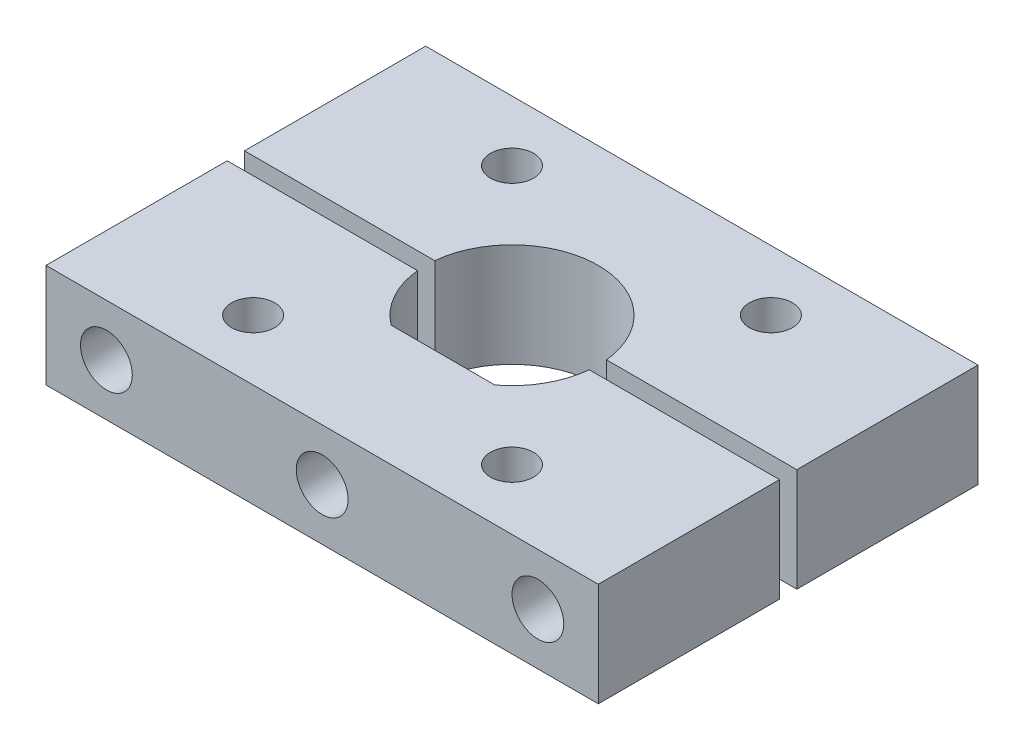
ISO-10303-21;
HEADER;
FILE_DESCRIPTION(('STEP AP214'),'2;1');
FILE_NAME('part.step','',(''),(''),'','','');
FILE_SCHEMA(('AUTOMOTIVE_DESIGN { 1 0 10303 214 1 1 1 1 }'));
ENDSEC;
DATA;
#1=APPLICATION_CONTEXT('core data for automotive mechanical design processes');
#2=APPLICATION_PROTOCOL_DEFINITION('international standard','automotive_design',2000,#1);
#3=PRODUCT_CONTEXT('',#1,'mechanical');
#4=PRODUCT('Part','Part','',(#3));
#5=PRODUCT_RELATED_PRODUCT_CATEGORY('part','',(#4));
#6=PRODUCT_DEFINITION_FORMATION('','',#4);
#7=PRODUCT_DEFINITION_CONTEXT('part definition',#1,'design');
#8=PRODUCT_DEFINITION('design','',#6,#7);
#9=PRODUCT_DEFINITION_SHAPE('','',#8);
#10=(LENGTH_UNIT() NAMED_UNIT(*) SI_UNIT(.MILLI.,.METRE.));
#11=(NAMED_UNIT(*) PLANE_ANGLE_UNIT() SI_UNIT($,.RADIAN.));
#12=(NAMED_UNIT(*) SI_UNIT($,.STERADIAN.) SOLID_ANGLE_UNIT());
#13=UNCERTAINTY_MEASURE_WITH_UNIT(LENGTH_MEASURE(1.E-05),#10,'distance_accuracy_value','');
#14=(GEOMETRIC_REPRESENTATION_CONTEXT(3) GLOBAL_UNCERTAINTY_ASSIGNED_CONTEXT((#13)) GLOBAL_UNIT_ASSIGNED_CONTEXT((#10,
#11,#12)) REPRESENTATION_CONTEXT('',''));
#15=CARTESIAN_POINT('',(0.,0.,0.));
#16=DIRECTION('',(0.,0.,1.));
#17=DIRECTION('',(1.,0.,0.));
#18=AXIS2_PLACEMENT_3D('',#15,#16,#17);
#19=CARTESIAN_POINT('',(-16.,3.,0.499999999999999));
#20=DIRECTION('',(1.,0.,0.));
#21=DIRECTION('',(0.,0.,-1.));
#22=AXIS2_PLACEMENT_3D('',#19,#20,#21);
#23=PLANE('',#22);
#24=DIRECTION('',(0.,0.,1.));
#25=VECTOR('',#24,1.);
#26=CARTESIAN_POINT('',(-16.,-3.,0.499999999999999));
#27=LINE('',#26,#25);
#28=CARTESIAN_POINT('',(-16.,-3.,0.499999999999999));
#29=VERTEX_POINT('',#28);
#30=CARTESIAN_POINT('',(-16.,-3.,11.));
#31=VERTEX_POINT('',#30);
#32=EDGE_CURVE('E144',#29,#31,#27,.T.);
#33=ORIENTED_EDGE('',*,*,#32,.T.);
#34=DIRECTION('',(0.,-1.,0.));
#35=VECTOR('',#34,1.);
#36=CARTESIAN_POINT('',(-16.,3.,11.));
#37=LINE('',#36,#35);
#38=CARTESIAN_POINT('',(-16.,3.,11.));
#39=VERTEX_POINT('',#38);
#40=EDGE_CURVE('E12',#39,#31,#37,.T.);
#41=ORIENTED_EDGE('',*,*,#40,.F.);
#42=DIRECTION('',(0.,0.,1.));
#43=VECTOR('',#42,1.);
#44=CARTESIAN_POINT('',(-16.,3.,0.499999999999999));
#45=LINE('',#44,#43);
#46=CARTESIAN_POINT('',(-16.,3.,0.499999999999999));
#47=VERTEX_POINT('',#46);
#48=EDGE_CURVE('E159',#47,#39,#45,.T.);
#49=ORIENTED_EDGE('',*,*,#48,.F.);
#50=DIRECTION('',(0.,-1.,0.));
#51=VECTOR('',#50,1.);
#52=CARTESIAN_POINT('',(-16.,3.,0.499999999999999));
#53=LINE('',#52,#51);
#54=EDGE_CURVE('E140',#47,#29,#53,.T.);
#55=ORIENTED_EDGE('',*,*,#54,.T.);
#56=EDGE_LOOP('',(#33,#41,#49,#55));
#57=FACE_BOUND('',#56,.T.);
#58=ADVANCED_FACE('F46',(#57),#23,.F.);
#59=CARTESIAN_POINT('',(-16.,3.,11.));
#60=DIRECTION('',(0.,0.,-1.));
#61=DIRECTION('',(-1.,0.,0.));
#62=AXIS2_PLACEMENT_3D('',#59,#60,#61);
#63=PLANE('',#62);
#64=CARTESIAN_POINT('',(12.5,0.,11.));
#65=DIRECTION('',(0.,0.,1.));
#66=DIRECTION('',(1.,0.,0.));
#67=AXIS2_PLACEMENT_3D('',#64,#65,#66);
#68=CIRCLE('',#67,1.5);
#69=CARTESIAN_POINT('',(14.,0.,11.));
#70=VERTEX_POINT('',#69);
#71=EDGE_CURVE('E360',#70,#70,#68,.T.);
#72=ORIENTED_EDGE('',*,*,#71,.F.);
#73=EDGE_LOOP('',(#72));
#74=FACE_BOUND('',#73,.T.);
#75=CARTESIAN_POINT('',(-12.5,0.,11.));
#76=DIRECTION('',(0.,0.,1.));
#77=DIRECTION('',(1.,0.,0.));
#78=AXIS2_PLACEMENT_3D('',#75,#76,#77);
#79=CIRCLE('',#78,1.5);
#80=CARTESIAN_POINT('',(-11.,0.,11.));
#81=VERTEX_POINT('',#80);
#82=EDGE_CURVE('E361',#81,#81,#79,.T.);
#83=ORIENTED_EDGE('',*,*,#82,.F.);
#84=EDGE_LOOP('',(#83));
#85=FACE_BOUND('',#84,.T.);
#86=CARTESIAN_POINT('',(0.,0.,11.));
#87=DIRECTION('',(0.,0.,1.));
#88=DIRECTION('',(1.,0.,0.));
#89=AXIS2_PLACEMENT_3D('',#86,#87,#88);
#90=CIRCLE('',#89,1.5);
#91=CARTESIAN_POINT('',(1.5,0.,11.));
#92=VERTEX_POINT('',#91);
#93=EDGE_CURVE('E174',#92,#92,#90,.T.);
#94=ORIENTED_EDGE('',*,*,#93,.F.);
#95=EDGE_LOOP('',(#94));
#96=FACE_BOUND('',#95,.T.);
#97=DIRECTION('',(1.,0.,0.));
#98=VECTOR('',#97,1.);
#99=CARTESIAN_POINT('',(-16.,-3.,11.));
#100=LINE('',#99,#98);
#101=CARTESIAN_POINT('',(16.,-3.,11.));
#102=VERTEX_POINT('',#101);
#103=EDGE_CURVE('E147',#31,#102,#100,.T.);
#104=ORIENTED_EDGE('',*,*,#103,.T.);
#105=DIRECTION('',(0.,-1.,0.));
#106=VECTOR('',#105,1.);
#107=CARTESIAN_POINT('',(16.,3.,11.));
#108=LINE('',#107,#106);
#109=CARTESIAN_POINT('',(16.,3.,11.));
#110=VERTEX_POINT('',#109);
#111=EDGE_CURVE('E55',#110,#102,#108,.T.);
#112=ORIENTED_EDGE('',*,*,#111,.F.);
#113=DIRECTION('',(1.,0.,0.));
#114=VECTOR('',#113,1.);
#115=CARTESIAN_POINT('',(-16.,3.,11.));
#116=LINE('',#115,#114);
#117=EDGE_CURVE('E107',#39,#110,#116,.T.);
#118=ORIENTED_EDGE('',*,*,#117,.F.);
#119=ORIENTED_EDGE('',*,*,#40,.T.);
#120=EDGE_LOOP('',(#104,#112,#118,#119));
#121=FACE_BOUND('',#120,.T.);
#122=ADVANCED_FACE('F232',(#74,#85,#96,#121),#63,.F.);
#123=CARTESIAN_POINT('',(16.,3.,0.499999999999999));
#124=DIRECTION('',(-1.,0.,0.));
#125=DIRECTION('',(0.,0.,1.));
#126=AXIS2_PLACEMENT_3D('',#123,#124,#125);
#127=PLANE('',#126);
#128=DIRECTION('',(0.,0.,-1.));
#129=VECTOR('',#128,1.);
#130=CARTESIAN_POINT('',(16.,-3.,0.499999999999999));
#131=LINE('',#130,#129);
#132=CARTESIAN_POINT('',(16.,-3.,0.499999999999999));
#133=VERTEX_POINT('',#132);
#134=EDGE_CURVE('E150',#102,#133,#131,.T.);
#135=ORIENTED_EDGE('',*,*,#134,.T.);
#136=DIRECTION('',(0.,-1.,0.));
#137=VECTOR('',#136,1.);
#138=CARTESIAN_POINT('',(16.,3.,0.499999999999999));
#139=LINE('',#138,#137);
#140=CARTESIAN_POINT('',(16.,3.,0.499999999999999));
#141=VERTEX_POINT('',#140);
#142=EDGE_CURVE('E166',#141,#133,#139,.T.);
#143=ORIENTED_EDGE('',*,*,#142,.F.);
#144=DIRECTION('',(0.,0.,-1.));
#145=VECTOR('',#144,1.);
#146=CARTESIAN_POINT('',(16.,3.,0.499999999999999));
#147=LINE('',#146,#145);
#148=EDGE_CURVE('E199',#110,#141,#147,.T.);
#149=ORIENTED_EDGE('',*,*,#148,.F.);
#150=ORIENTED_EDGE('',*,*,#111,.T.);
#151=EDGE_LOOP('',(#135,#143,#149,#150));
#152=FACE_BOUND('',#151,.T.);
#153=ADVANCED_FACE('F236',(#152),#127,.F.);
#154=CARTESIAN_POINT('',(16.,3.,0.499999999999999));
#155=DIRECTION('',(0.,0.,1.));
#156=DIRECTION('',(1.,0.,0.));
#157=AXIS2_PLACEMENT_3D('',#154,#155,#156);
#158=PLANE('',#157);
#159=CARTESIAN_POINT('',(12.5,0.,0.499999999999999));
#160=DIRECTION('',(0.,0.,1.));
#161=DIRECTION('',(1.,0.,0.));
#162=AXIS2_PLACEMENT_3D('',#159,#160,#161);
#163=CIRCLE('',#162,1.5);
#164=CARTESIAN_POINT('',(14.,0.,0.499999999999999));
#165=VERTEX_POINT('',#164);
#166=EDGE_CURVE('E49',#165,#165,#163,.T.);
#167=ORIENTED_EDGE('',*,*,#166,.T.);
#168=EDGE_LOOP('',(#167));
#169=FACE_BOUND('',#168,.T.);
#170=DIRECTION('',(-1.,0.,0.));
#171=VECTOR('',#170,1.);
#172=CARTESIAN_POINT('',(16.,-3.,0.499999999999999));
#173=LINE('',#172,#171);
#174=CARTESIAN_POINT('',(4.9749371855331,-3.,0.5));
#175=VERTEX_POINT('',#174);
#176=EDGE_CURVE('E152',#133,#175,#173,.T.);
#177=ORIENTED_EDGE('',*,*,#176,.T.);
#178=DIRECTION('',(0.,-1.,0.));
#179=VECTOR('',#178,1.);
#180=CARTESIAN_POINT('',(4.9749371855331,3.,0.5));
#181=LINE('',#180,#179);
#182=CARTESIAN_POINT('',(4.9749371855331,3.,0.5));
#183=VERTEX_POINT('',#182);
#184=EDGE_CURVE('E163',#183,#175,#181,.T.);
#185=ORIENTED_EDGE('',*,*,#184,.F.);
#186=DIRECTION('',(-1.,0.,0.));
#187=VECTOR('',#186,1.);
#188=CARTESIAN_POINT('',(16.,3.,0.499999999999999));
#189=LINE('',#188,#187);
#190=EDGE_CURVE('E201',#141,#183,#189,.T.);
#191=ORIENTED_EDGE('',*,*,#190,.F.);
#192=ORIENTED_EDGE('',*,*,#142,.T.);
#193=EDGE_LOOP('',(#177,#185,#191,#192));
#194=FACE_BOUND('',#193,.T.);
#195=ADVANCED_FACE('F207',(#169,#194),#158,.F.);
#196=CARTESIAN_POINT('',(0.,3.,0.));
#197=DIRECTION('',(0.,-1.,0.));
#198=DIRECTION('',(0.,0.,-1.));
#199=AXIS2_PLACEMENT_3D('',#196,#197,#198);
#200=CYLINDRICAL_SURFACE('',#199,5.);
#201=CARTESIAN_POINT('',(0.,-3.,0.));
#202=DIRECTION('',(0.,-1.,0.));
#203=DIRECTION('',(0.,0.,-1.));
#204=AXIS2_PLACEMENT_3D('',#201,#202,#203);
#205=CIRCLE('',#204,5.);
#206=CARTESIAN_POINT('',(3.,-3.,4.));
#207=VERTEX_POINT('',#206);
#208=EDGE_CURVE('E154',#175,#207,#205,.T.);
#209=ORIENTED_EDGE('',*,*,#208,.T.);
#210=DIRECTION('',(0.,-1.,0.));
#211=VECTOR('',#210,1.);
#212=CARTESIAN_POINT('',(3.,3.,4.));
#213=LINE('',#212,#211);
#214=CARTESIAN_POINT('',(3.,3.,4.));
#215=VERTEX_POINT('',#214);
#216=EDGE_CURVE('E135',#215,#207,#213,.T.);
#217=ORIENTED_EDGE('',*,*,#216,.F.);
#218=CARTESIAN_POINT('',(0.,3.,0.));
#219=DIRECTION('',(0.,-1.,0.));
#220=DIRECTION('',(0.,0.,-1.));
#221=AXIS2_PLACEMENT_3D('',#218,#219,#220);
#222=CIRCLE('',#221,5.);
#223=EDGE_CURVE('E126',#183,#215,#222,.T.);
#224=ORIENTED_EDGE('',*,*,#223,.F.);
#225=ORIENTED_EDGE('',*,*,#184,.T.);
#226=EDGE_LOOP('',(#209,#217,#224,#225));
#227=FACE_BOUND('',#226,.T.);
#228=ADVANCED_FACE('F211',(#227),#200,.F.);
#229=CARTESIAN_POINT('',(-3.,3.,4.));
#230=DIRECTION('',(0.,0.,1.));
#231=DIRECTION('',(1.,0.,0.));
#232=AXIS2_PLACEMENT_3D('',#229,#230,#231);
#233=PLANE('',#232);
#234=CARTESIAN_POINT('',(0.,0.,4.));
#235=DIRECTION('',(0.,0.,1.));
#236=DIRECTION('',(1.,0.,0.));
#237=AXIS2_PLACEMENT_3D('',#234,#235,#236);
#238=CIRCLE('',#237,1.5);
#239=CARTESIAN_POINT('',(1.5,0.,4.));
#240=VERTEX_POINT('',#239);
#241=EDGE_CURVE('E173',#240,#240,#238,.T.);
#242=ORIENTED_EDGE('',*,*,#241,.T.);
#243=EDGE_LOOP('',(#242));
#244=FACE_BOUND('',#243,.T.);
#245=DIRECTION('',(-1.,0.,0.));
#246=VECTOR('',#245,1.);
#247=CARTESIAN_POINT('',(-3.,-3.,4.));
#248=LINE('',#247,#246);
#249=CARTESIAN_POINT('',(-3.,-3.,4.));
#250=VERTEX_POINT('',#249);
#251=EDGE_CURVE('E134',#207,#250,#248,.T.);
#252=ORIENTED_EDGE('',*,*,#251,.T.);
#253=DIRECTION('',(0.,-1.,0.));
#254=VECTOR('',#253,1.);
#255=CARTESIAN_POINT('',(-3.,3.,4.));
#256=LINE('',#255,#254);
#257=CARTESIAN_POINT('',(-3.,3.,4.));
#258=VERTEX_POINT('',#257);
#259=EDGE_CURVE('E131',#258,#250,#256,.T.);
#260=ORIENTED_EDGE('',*,*,#259,.F.);
#261=DIRECTION('',(-1.,0.,0.));
#262=VECTOR('',#261,1.);
#263=CARTESIAN_POINT('',(-3.,3.,4.));
#264=LINE('',#263,#262);
#265=EDGE_CURVE('E120',#215,#258,#264,.T.);
#266=ORIENTED_EDGE('',*,*,#265,.F.);
#267=ORIENTED_EDGE('',*,*,#216,.T.);
#268=EDGE_LOOP('',(#252,#260,#266,#267));
#269=FACE_BOUND('',#268,.T.);
#270=ADVANCED_FACE('F132',(#244,#269),#233,.F.);
#271=CARTESIAN_POINT('',(0.,3.,0.));
#272=DIRECTION('',(0.,-1.,0.));
#273=DIRECTION('',(0.,0.,-1.));
#274=AXIS2_PLACEMENT_3D('',#271,#272,#273);
#275=CYLINDRICAL_SURFACE('',#274,5.);
#276=CARTESIAN_POINT('',(0.,-3.,0.));
#277=DIRECTION('',(0.,-1.,0.));
#278=DIRECTION('',(0.,0.,1.));
#279=AXIS2_PLACEMENT_3D('',#276,#277,#278);
#280=CIRCLE('',#279,5.);
#281=CARTESIAN_POINT('',(-4.9749371855331,-3.,0.499999999999999));
#282=VERTEX_POINT('',#281);
#283=EDGE_CURVE('E93',#250,#282,#280,.T.);
#284=ORIENTED_EDGE('',*,*,#283,.T.);
#285=DIRECTION('',(0.,-1.,0.));
#286=VECTOR('',#285,1.);
#287=CARTESIAN_POINT('',(-4.9749371855331,3.,0.499999999999999));
#288=LINE('',#287,#286);
#289=CARTESIAN_POINT('',(-4.9749371855331,3.,0.499999999999999));
#290=VERTEX_POINT('',#289);
#291=EDGE_CURVE('E136',#290,#282,#288,.T.);
#292=ORIENTED_EDGE('',*,*,#291,.F.);
#293=CARTESIAN_POINT('',(0.,3.,0.));
#294=DIRECTION('',(0.,-1.,0.));
#295=DIRECTION('',(0.,0.,1.));
#296=AXIS2_PLACEMENT_3D('',#293,#294,#295);
#297=CIRCLE('',#296,5.);
#298=EDGE_CURVE('E124',#258,#290,#297,.T.);
#299=ORIENTED_EDGE('',*,*,#298,.F.);
#300=ORIENTED_EDGE('',*,*,#259,.T.);
#301=EDGE_LOOP('',(#284,#292,#299,#300));
#302=FACE_BOUND('',#301,.T.);
#303=ADVANCED_FACE('F138',(#302),#275,.F.);
#304=CARTESIAN_POINT('',(-16.,3.,0.499999999999999));
#305=DIRECTION('',(0.,0.,1.));
#306=DIRECTION('',(1.,0.,0.));
#307=AXIS2_PLACEMENT_3D('',#304,#305,#306);
#308=PLANE('',#307);
#309=CARTESIAN_POINT('',(-12.5,0.,0.499999999999999));
#310=DIRECTION('',(0.,0.,1.));
#311=DIRECTION('',(1.,0.,0.));
#312=AXIS2_PLACEMENT_3D('',#309,#310,#311);
#313=CIRCLE('',#312,1.5);
#314=CARTESIAN_POINT('',(-11.,0.,0.499999999999999));
#315=VERTEX_POINT('',#314);
#316=EDGE_CURVE('E171',#315,#315,#313,.T.);
#317=ORIENTED_EDGE('',*,*,#316,.T.);
#318=EDGE_LOOP('',(#317));
#319=FACE_BOUND('',#318,.T.);
#320=DIRECTION('',(-1.,0.,0.));
#321=VECTOR('',#320,1.);
#322=CARTESIAN_POINT('',(-16.,-3.,0.499999999999999));
#323=LINE('',#322,#321);
#324=EDGE_CURVE('E99',#282,#29,#323,.T.);
#325=ORIENTED_EDGE('',*,*,#324,.T.);
#326=ORIENTED_EDGE('',*,*,#54,.F.);
#327=DIRECTION('',(-1.,0.,0.));
#328=VECTOR('',#327,1.);
#329=CARTESIAN_POINT('',(-16.,3.,0.499999999999999));
#330=LINE('',#329,#328);
#331=EDGE_CURVE('E64',#290,#47,#330,.T.);
#332=ORIENTED_EDGE('',*,*,#331,.F.);
#333=ORIENTED_EDGE('',*,*,#291,.T.);
#334=EDGE_LOOP('',(#325,#326,#332,#333));
#335=FACE_BOUND('',#334,.T.);
#336=ADVANCED_FACE('F219',(#319,#335),#308,.F.);
#337=CARTESIAN_POINT('',(0.,3.,0.));
#338=DIRECTION('',(0.,-1.,0.));
#339=DIRECTION('',(0.,0.,-1.));
#340=AXIS2_PLACEMENT_3D('',#337,#338,#339);
#341=PLANE('',#340);
#342=CARTESIAN_POINT('',(-7.5,3.,7.5));
#343=DIRECTION('',(0.,1.,0.));
#344=DIRECTION('',(0.,0.,1.));
#345=AXIS2_PLACEMENT_3D('',#342,#343,#344);
#346=CIRCLE('',#345,1.24999999999999);
#347=CARTESIAN_POINT('',(-7.5,3.,8.74999999999999));
#348=VERTEX_POINT('',#347);
#349=EDGE_CURVE('E179',#348,#348,#346,.T.);
#350=ORIENTED_EDGE('',*,*,#349,.F.);
#351=EDGE_LOOP('',(#350));
#352=FACE_BOUND('',#351,.T.);
#353=CARTESIAN_POINT('',(7.5,3.,7.5));
#354=DIRECTION('',(0.,1.,0.));
#355=DIRECTION('',(0.,0.,1.));
#356=AXIS2_PLACEMENT_3D('',#353,#354,#355);
#357=CIRCLE('',#356,1.24999999999999);
#358=CARTESIAN_POINT('',(7.5,3.,8.74999999999999));
#359=VERTEX_POINT('',#358);
#360=EDGE_CURVE('E188',#359,#359,#357,.T.);
#361=ORIENTED_EDGE('',*,*,#360,.F.);
#362=EDGE_LOOP('',(#361));
#363=FACE_BOUND('',#362,.T.);
#364=ORIENTED_EDGE('',*,*,#48,.T.);
#365=ORIENTED_EDGE('',*,*,#117,.T.);
#366=ORIENTED_EDGE('',*,*,#148,.T.);
#367=ORIENTED_EDGE('',*,*,#190,.T.);
#368=ORIENTED_EDGE('',*,*,#223,.T.);
#369=ORIENTED_EDGE('',*,*,#265,.T.);
#370=ORIENTED_EDGE('',*,*,#298,.T.);
#371=ORIENTED_EDGE('',*,*,#331,.T.);
#372=EDGE_LOOP('',(#364,#365,#366,#367,#368,#369,#370,#371));
#373=FACE_BOUND('',#372,.T.);
#374=ADVANCED_FACE('F122',(#352,#363,#373),#341,.F.);
#375=CARTESIAN_POINT('',(0.,-3.,0.));
#376=DIRECTION('',(0.,-1.,0.));
#377=DIRECTION('',(0.,0.,-1.));
#378=AXIS2_PLACEMENT_3D('',#375,#376,#377);
#379=PLANE('',#378);
#380=CARTESIAN_POINT('',(-7.5,-3.,7.5));
#381=DIRECTION('',(0.,1.,0.));
#382=DIRECTION('',(0.,0.,1.));
#383=AXIS2_PLACEMENT_3D('',#380,#381,#382);
#384=CIRCLE('',#383,1.25);
#385=CARTESIAN_POINT('',(-7.5,-3.,8.75));
#386=VERTEX_POINT('',#385);
#387=EDGE_CURVE('E183',#386,#386,#384,.T.);
#388=ORIENTED_EDGE('',*,*,#387,.T.);
#389=EDGE_LOOP('',(#388));
#390=FACE_BOUND('',#389,.T.);
#391=CARTESIAN_POINT('',(7.5,-3.,7.5));
#392=DIRECTION('',(0.,1.,0.));
#393=DIRECTION('',(0.,0.,1.));
#394=AXIS2_PLACEMENT_3D('',#391,#392,#393);
#395=CIRCLE('',#394,1.25);
#396=CARTESIAN_POINT('',(7.5,-3.,8.75));
#397=VERTEX_POINT('',#396);
#398=EDGE_CURVE('E148',#397,#397,#395,.T.);
#399=ORIENTED_EDGE('',*,*,#398,.T.);
#400=EDGE_LOOP('',(#399));
#401=FACE_BOUND('',#400,.T.);
#402=ORIENTED_EDGE('',*,*,#32,.F.);
#403=ORIENTED_EDGE('',*,*,#324,.F.);
#404=ORIENTED_EDGE('',*,*,#283,.F.);
#405=ORIENTED_EDGE('',*,*,#251,.F.);
#406=ORIENTED_EDGE('',*,*,#208,.F.);
#407=ORIENTED_EDGE('',*,*,#176,.F.);
#408=ORIENTED_EDGE('',*,*,#134,.F.);
#409=ORIENTED_EDGE('',*,*,#103,.F.);
#410=EDGE_LOOP('',(#402,#403,#404,#405,#406,#407,#408,#409));
#411=FACE_BOUND('',#410,.T.);
#412=ADVANCED_FACE('F214',(#390,#401,#411),#379,.T.);
#413=CARTESIAN_POINT('',(7.5,3.,7.5));
#414=DIRECTION('',(0.,1.,0.));
#415=DIRECTION('',(0.,0.,1.));
#416=AXIS2_PLACEMENT_3D('',#413,#414,#415);
#417=CYLINDRICAL_SURFACE('',#416,1.24999999999999);
#418=ORIENTED_EDGE('',*,*,#398,.F.);
#419=EDGE_LOOP('',(#418));
#420=FACE_BOUND('',#419,.T.);
#421=ORIENTED_EDGE('',*,*,#360,.T.);
#422=EDGE_LOOP('',(#421));
#423=FACE_BOUND('',#422,.T.);
#424=ADVANCED_FACE('F279',(#420,#423),#417,.F.);
#425=CARTESIAN_POINT('',(-7.5,3.,7.5));
#426=DIRECTION('',(0.,1.,0.));
#427=DIRECTION('',(0.,0.,1.));
#428=AXIS2_PLACEMENT_3D('',#425,#426,#427);
#429=CYLINDRICAL_SURFACE('',#428,1.24999999999999);
#430=ORIENTED_EDGE('',*,*,#387,.F.);
#431=EDGE_LOOP('',(#430));
#432=FACE_BOUND('',#431,.T.);
#433=ORIENTED_EDGE('',*,*,#349,.T.);
#434=EDGE_LOOP('',(#433));
#435=FACE_BOUND('',#434,.T.);
#436=ADVANCED_FACE('F289',(#432,#435),#429,.F.);
#437=CARTESIAN_POINT('',(-12.5,0.,-11.));
#438=DIRECTION('',(0.,0.,1.));
#439=DIRECTION('',(1.,0.,0.));
#440=AXIS2_PLACEMENT_3D('',#437,#438,#439);
#441=CYLINDRICAL_SURFACE('',#440,1.5);
#442=ORIENTED_EDGE('',*,*,#82,.T.);
#443=EDGE_LOOP('',(#442));
#444=FACE_BOUND('',#443,.T.);
#445=ORIENTED_EDGE('',*,*,#316,.F.);
#446=EDGE_LOOP('',(#445));
#447=FACE_BOUND('',#446,.T.);
#448=ADVANCED_FACE('F299',(#444,#447),#441,.F.);
#449=CARTESIAN_POINT('',(0.,0.,-11.));
#450=DIRECTION('',(0.,0.,1.));
#451=DIRECTION('',(1.,0.,0.));
#452=AXIS2_PLACEMENT_3D('',#449,#450,#451);
#453=CYLINDRICAL_SURFACE('',#452,1.5);
#454=ORIENTED_EDGE('',*,*,#93,.T.);
#455=EDGE_LOOP('',(#454));
#456=FACE_BOUND('',#455,.T.);
#457=ORIENTED_EDGE('',*,*,#241,.F.);
#458=EDGE_LOOP('',(#457));
#459=FACE_BOUND('',#458,.T.);
#460=ADVANCED_FACE('F334',(#456,#459),#453,.F.);
#461=CARTESIAN_POINT('',(12.5,0.,-11.));
#462=DIRECTION('',(0.,0.,1.));
#463=DIRECTION('',(1.,0.,0.));
#464=AXIS2_PLACEMENT_3D('',#461,#462,#463);
#465=CYLINDRICAL_SURFACE('',#464,1.5);
#466=ORIENTED_EDGE('',*,*,#71,.T.);
#467=EDGE_LOOP('',(#466));
#468=FACE_BOUND('',#467,.T.);
#469=ORIENTED_EDGE('',*,*,#166,.F.);
#470=EDGE_LOOP('',(#469));
#471=FACE_BOUND('',#470,.T.);
#472=ADVANCED_FACE('F341',(#468,#471),#465,.F.);
#473=CLOSED_SHELL('',(#58,#122,#153,#195,#228,#270,#303,#336,#374,#412,#424,#436,#448,#460,#472));
#474=MANIFOLD_SOLID_BREP('B2',#473);
#475=CARTESIAN_POINT('',(-16.,3.,-11.));
#476=DIRECTION('',(1.,0.,0.));
#477=DIRECTION('',(0.,0.,-1.));
#478=AXIS2_PLACEMENT_3D('',#475,#476,#477);
#479=PLANE('',#478);
#480=DIRECTION('',(0.,0.,1.));
#481=VECTOR('',#480,1.);
#482=CARTESIAN_POINT('',(-16.,-3.,-11.));
#483=LINE('',#482,#481);
#484=CARTESIAN_POINT('',(-16.,-3.,-11.));
#485=VERTEX_POINT('',#484);
#486=CARTESIAN_POINT('',(-16.,-3.,-0.499999999999999));
#487=VERTEX_POINT('',#486);
#488=EDGE_CURVE('E466',#485,#487,#483,.T.);
#489=ORIENTED_EDGE('',*,*,#488,.T.);
#490=DIRECTION('',(0.,-1.,0.));
#491=VECTOR('',#490,1.);
#492=CARTESIAN_POINT('',(-16.,3.,-0.499999999999999));
#493=LINE('',#492,#491);
#494=CARTESIAN_POINT('',(-16.,3.,-0.499999999999999));
#495=VERTEX_POINT('',#494);
#496=EDGE_CURVE('E44',#495,#487,#493,.T.);
#497=ORIENTED_EDGE('',*,*,#496,.F.);
#498=DIRECTION('',(0.,0.,1.));
#499=VECTOR('',#498,1.);
#500=CARTESIAN_POINT('',(-16.,3.,-11.));
#501=LINE('',#500,#499);
#502=CARTESIAN_POINT('',(-16.,3.,-11.));
#503=VERTEX_POINT('',#502);
#504=EDGE_CURVE('E477',#503,#495,#501,.T.);
#505=ORIENTED_EDGE('',*,*,#504,.F.);
#506=DIRECTION('',(0.,-1.,0.));
#507=VECTOR('',#506,1.);
#508=CARTESIAN_POINT('',(-16.,3.,-11.));
#509=LINE('',#508,#507);
#510=EDGE_CURVE('E462',#503,#485,#509,.T.);
#511=ORIENTED_EDGE('',*,*,#510,.T.);
#512=EDGE_LOOP('',(#489,#497,#505,#511));
#513=FACE_BOUND('',#512,.T.);
#514=ADVANCED_FACE('F382',(#513),#479,.F.);
#515=CARTESIAN_POINT('',(-4.9749371855331,3.,-0.5));
#516=DIRECTION('',(0.,0.,-1.));
#517=DIRECTION('',(-1.,0.,0.));
#518=AXIS2_PLACEMENT_3D('',#515,#516,#517);
#519=PLANE('',#518);
#520=CARTESIAN_POINT('',(-12.5,0.,-0.5));
#521=DIRECTION('',(0.,0.,-1.));
#522=DIRECTION('',(-1.,0.,0.));
#523=AXIS2_PLACEMENT_3D('',#520,#521,#522);
#524=CIRCLE('',#523,1.24999999999999);
#525=CARTESIAN_POINT('',(-13.75,0.,-0.5));
#526=VERTEX_POINT('',#525);
#527=EDGE_CURVE('E526',#526,#526,#524,.T.);
#528=ORIENTED_EDGE('',*,*,#527,.T.);
#529=EDGE_LOOP('',(#528));
#530=FACE_BOUND('',#529,.T.);
#531=DIRECTION('',(1.,0.,0.));
#532=VECTOR('',#531,1.);
#533=CARTESIAN_POINT('',(-4.9749371855331,-3.,-0.5));
#534=LINE('',#533,#532);
#535=CARTESIAN_POINT('',(-4.9749371855331,-3.,-0.500000000000001));
#536=VERTEX_POINT('',#535);
#537=EDGE_CURVE('E469',#487,#536,#534,.T.);
#538=ORIENTED_EDGE('',*,*,#537,.T.);
#539=DIRECTION('',(0.,-1.,0.));
#540=VECTOR('',#539,1.);
#541=CARTESIAN_POINT('',(-4.9749371855331,3.,-0.500000000000001));
#542=LINE('',#541,#540);
#543=CARTESIAN_POINT('',(-4.9749371855331,3.,-0.500000000000001));
#544=VERTEX_POINT('',#543);
#545=EDGE_CURVE('E390',#544,#536,#542,.T.);
#546=ORIENTED_EDGE('',*,*,#545,.F.);
#547=DIRECTION('',(1.,0.,0.));
#548=VECTOR('',#547,1.);
#549=CARTESIAN_POINT('',(-4.9749371855331,3.,-0.5));
#550=LINE('',#549,#548);
#551=EDGE_CURVE('E435',#495,#544,#550,.T.);
#552=ORIENTED_EDGE('',*,*,#551,.F.);
#553=ORIENTED_EDGE('',*,*,#496,.T.);
#554=EDGE_LOOP('',(#538,#546,#552,#553));
#555=FACE_BOUND('',#554,.T.);
#556=ADVANCED_FACE('F505',(#530,#555),#519,.F.);
#557=CARTESIAN_POINT('',(0.,3.,0.));
#558=DIRECTION('',(0.,-1.,0.));
#559=DIRECTION('',(0.,0.,-1.));
#560=AXIS2_PLACEMENT_3D('',#557,#558,#559);
#561=CYLINDRICAL_SURFACE('',#560,5.);
#562=CARTESIAN_POINT('',(0.,-3.,0.));
#563=DIRECTION('',(0.,-1.,0.));
#564=DIRECTION('',(0.,0.,1.));
#565=AXIS2_PLACEMENT_3D('',#562,#563,#564);
#566=CIRCLE('',#565,5.);
#567=CARTESIAN_POINT('',(4.9749371855331,-3.,-0.5));
#568=VERTEX_POINT('',#567);
#569=EDGE_CURVE('E472',#536,#568,#566,.T.);
#570=ORIENTED_EDGE('',*,*,#569,.T.);
#571=DIRECTION('',(0.,-1.,0.));
#572=VECTOR('',#571,1.);
#573=CARTESIAN_POINT('',(4.9749371855331,3.,-0.5));
#574=LINE('',#573,#572);
#575=CARTESIAN_POINT('',(4.9749371855331,3.,-0.5));
#576=VERTEX_POINT('',#575);
#577=EDGE_CURVE('E457',#576,#568,#574,.T.);
#578=ORIENTED_EDGE('',*,*,#577,.F.);
#579=CARTESIAN_POINT('',(0.,3.,0.));
#580=DIRECTION('',(0.,-1.,0.));
#581=DIRECTION('',(0.,0.,1.));
#582=AXIS2_PLACEMENT_3D('',#579,#580,#581);
#583=CIRCLE('',#582,5.);
#584=EDGE_CURVE('E448',#544,#576,#583,.T.);
#585=ORIENTED_EDGE('',*,*,#584,.F.);
#586=ORIENTED_EDGE('',*,*,#545,.T.);
#587=EDGE_LOOP('',(#570,#578,#585,#586));
#588=FACE_BOUND('',#587,.T.);
#589=ADVANCED_FACE('F483',(#588),#561,.F.);
#590=CARTESIAN_POINT('',(4.9749371855331,3.,-0.5));
#591=DIRECTION('',(0.,0.,-1.));
#592=DIRECTION('',(-1.,0.,0.));
#593=AXIS2_PLACEMENT_3D('',#590,#591,#592);
#594=PLANE('',#593);
#595=CARTESIAN_POINT('',(12.5,0.,-0.5));
#596=DIRECTION('',(0.,0.,-1.));
#597=DIRECTION('',(-1.,0.,0.));
#598=AXIS2_PLACEMENT_3D('',#595,#596,#597);
#599=CIRCLE('',#598,1.24999999999999);
#600=CARTESIAN_POINT('',(11.25,0.,-0.500000000000001));
#601=VERTEX_POINT('',#600);
#602=EDGE_CURVE('E470',#601,#601,#599,.T.);
#603=ORIENTED_EDGE('',*,*,#602,.T.);
#604=EDGE_LOOP('',(#603));
#605=FACE_BOUND('',#604,.T.);
#606=DIRECTION('',(1.,0.,0.));
#607=VECTOR('',#606,1.);
#608=CARTESIAN_POINT('',(4.9749371855331,-3.,-0.5));
#609=LINE('',#608,#607);
#610=CARTESIAN_POINT('',(16.,-3.,-0.499999999999999));
#611=VERTEX_POINT('',#610);
#612=EDGE_CURVE('E456',#568,#611,#609,.T.);
#613=ORIENTED_EDGE('',*,*,#612,.T.);
#614=DIRECTION('',(0.,-1.,0.));
#615=VECTOR('',#614,1.);
#616=CARTESIAN_POINT('',(16.,3.,-0.499999999999999));
#617=LINE('',#616,#615);
#618=CARTESIAN_POINT('',(16.,3.,-0.499999999999999));
#619=VERTEX_POINT('',#618);
#620=EDGE_CURVE('E453',#619,#611,#617,.T.);
#621=ORIENTED_EDGE('',*,*,#620,.F.);
#622=DIRECTION('',(1.,0.,0.));
#623=VECTOR('',#622,1.);
#624=CARTESIAN_POINT('',(4.9749371855331,3.,-0.5));
#625=LINE('',#624,#623);
#626=EDGE_CURVE('E442',#576,#619,#625,.T.);
#627=ORIENTED_EDGE('',*,*,#626,.F.);
#628=ORIENTED_EDGE('',*,*,#577,.T.);
#629=EDGE_LOOP('',(#613,#621,#627,#628));
#630=FACE_BOUND('',#629,.T.);
#631=ADVANCED_FACE('F454',(#605,#630),#594,.F.);
#632=CARTESIAN_POINT('',(16.,3.,-11.));
#633=DIRECTION('',(-1.,0.,0.));
#634=DIRECTION('',(0.,0.,1.));
#635=AXIS2_PLACEMENT_3D('',#632,#633,#634);
#636=PLANE('',#635);
#637=DIRECTION('',(0.,0.,-1.));
#638=VECTOR('',#637,1.);
#639=CARTESIAN_POINT('',(16.,-3.,-11.));
#640=LINE('',#639,#638);
#641=CARTESIAN_POINT('',(16.,-3.,-11.));
#642=VERTEX_POINT('',#641);
#643=EDGE_CURVE('E421',#611,#642,#640,.T.);
#644=ORIENTED_EDGE('',*,*,#643,.T.);
#645=DIRECTION('',(0.,-1.,0.));
#646=VECTOR('',#645,1.);
#647=CARTESIAN_POINT('',(16.,3.,-11.));
#648=LINE('',#647,#646);
#649=CARTESIAN_POINT('',(16.,3.,-11.));
#650=VERTEX_POINT('',#649);
#651=EDGE_CURVE('E458',#650,#642,#648,.T.);
#652=ORIENTED_EDGE('',*,*,#651,.F.);
#653=DIRECTION('',(0.,0.,-1.));
#654=VECTOR('',#653,1.);
#655=CARTESIAN_POINT('',(16.,3.,-11.));
#656=LINE('',#655,#654);
#657=EDGE_CURVE('E446',#619,#650,#656,.T.);
#658=ORIENTED_EDGE('',*,*,#657,.F.);
#659=ORIENTED_EDGE('',*,*,#620,.T.);
#660=EDGE_LOOP('',(#644,#652,#658,#659));
#661=FACE_BOUND('',#660,.T.);
#662=ADVANCED_FACE('F460',(#661),#636,.F.);
#663=CARTESIAN_POINT('',(-16.,3.,-11.));
#664=DIRECTION('',(0.,0.,1.));
#665=DIRECTION('',(1.,0.,0.));
#666=AXIS2_PLACEMENT_3D('',#663,#664,#665);
#667=PLANE('',#666);
#668=CARTESIAN_POINT('',(-12.5,0.,-11.));
#669=DIRECTION('',(0.,0.,1.));
#670=DIRECTION('',(1.,0.,0.));
#671=AXIS2_PLACEMENT_3D('',#668,#669,#670);
#672=CIRCLE('',#671,1.25);
#673=CARTESIAN_POINT('',(-11.25,0.,-11.));
#674=VERTEX_POINT('',#673);
#675=EDGE_CURVE('E532',#674,#674,#672,.T.);
#676=ORIENTED_EDGE('',*,*,#675,.T.);
#677=EDGE_LOOP('',(#676));
#678=FACE_BOUND('',#677,.T.);
#679=CARTESIAN_POINT('',(12.5,0.,-11.));
#680=DIRECTION('',(0.,0.,1.));
#681=DIRECTION('',(1.,0.,0.));
#682=AXIS2_PLACEMENT_3D('',#679,#680,#681);
#683=CIRCLE('',#682,1.25);
#684=CARTESIAN_POINT('',(13.75,0.,-11.));
#685=VERTEX_POINT('',#684);
#686=EDGE_CURVE('E523',#685,#685,#683,.T.);
#687=ORIENTED_EDGE('',*,*,#686,.T.);
#688=EDGE_LOOP('',(#687));
#689=FACE_BOUND('',#688,.T.);
#690=DIRECTION('',(-1.,0.,0.));
#691=VECTOR('',#690,1.);
#692=CARTESIAN_POINT('',(-16.,-3.,-11.));
#693=LINE('',#692,#691);
#694=EDGE_CURVE('E427',#642,#485,#693,.T.);
#695=ORIENTED_EDGE('',*,*,#694,.T.);
#696=ORIENTED_EDGE('',*,*,#510,.F.);
#697=DIRECTION('',(-1.,0.,0.));
#698=VECTOR('',#697,1.);
#699=CARTESIAN_POINT('',(-16.,3.,-11.));
#700=LINE('',#699,#698);
#701=EDGE_CURVE('E398',#650,#503,#700,.T.);
#702=ORIENTED_EDGE('',*,*,#701,.F.);
#703=ORIENTED_EDGE('',*,*,#651,.T.);
#704=EDGE_LOOP('',(#695,#696,#702,#703));
#705=FACE_BOUND('',#704,.T.);
#706=ADVANCED_FACE('F490',(#678,#689,#705),#667,.F.);
#707=CARTESIAN_POINT('',(0.,3.,0.));
#708=DIRECTION('',(0.,1.,0.));
#709=DIRECTION('',(0.,0.,1.));
#710=AXIS2_PLACEMENT_3D('',#707,#708,#709);
#711=PLANE('',#710);
#712=CARTESIAN_POINT('',(-7.5,3.,-7.5));
#713=DIRECTION('',(0.,1.,0.));
#714=DIRECTION('',(0.,0.,1.));
#715=AXIS2_PLACEMENT_3D('',#712,#713,#714);
#716=CIRCLE('',#715,1.24999999999999);
#717=CARTESIAN_POINT('',(-7.5,3.,-6.25000000000001));
#718=VERTEX_POINT('',#717);
#719=EDGE_CURVE('E543',#718,#718,#716,.T.);
#720=ORIENTED_EDGE('',*,*,#719,.F.);
#721=EDGE_LOOP('',(#720));
#722=FACE_BOUND('',#721,.T.);
#723=CARTESIAN_POINT('',(7.5,3.,-7.5));
#724=DIRECTION('',(0.,1.,0.));
#725=DIRECTION('',(0.,0.,1.));
#726=AXIS2_PLACEMENT_3D('',#723,#724,#725);
#727=CIRCLE('',#726,1.24999999999999);
#728=CARTESIAN_POINT('',(7.5,3.,-6.25000000000001));
#729=VERTEX_POINT('',#728);
#730=EDGE_CURVE('E537',#729,#729,#727,.T.);
#731=ORIENTED_EDGE('',*,*,#730,.F.);
#732=EDGE_LOOP('',(#731));
#733=FACE_BOUND('',#732,.T.);
#734=ORIENTED_EDGE('',*,*,#504,.T.);
#735=ORIENTED_EDGE('',*,*,#551,.T.);
#736=ORIENTED_EDGE('',*,*,#584,.T.);
#737=ORIENTED_EDGE('',*,*,#626,.T.);
#738=ORIENTED_EDGE('',*,*,#657,.T.);
#739=ORIENTED_EDGE('',*,*,#701,.T.);
#740=EDGE_LOOP('',(#734,#735,#736,#737,#738,#739));
#741=FACE_BOUND('',#740,.T.);
#742=ADVANCED_FACE('F444',(#722,#733,#741),#711,.T.);
#743=CARTESIAN_POINT('',(0.,-3.,0.));
#744=DIRECTION('',(0.,1.,0.));
#745=DIRECTION('',(0.,0.,1.));
#746=AXIS2_PLACEMENT_3D('',#743,#744,#745);
#747=PLANE('',#746);
#748=CARTESIAN_POINT('',(-7.5,-3.,-7.5));
#749=DIRECTION('',(0.,1.,0.));
#750=DIRECTION('',(0.,0.,1.));
#751=AXIS2_PLACEMENT_3D('',#748,#749,#750);
#752=CIRCLE('',#751,1.25);
#753=CARTESIAN_POINT('',(-7.5,-3.,-6.25));
#754=VERTEX_POINT('',#753);
#755=EDGE_CURVE('E540',#754,#754,#752,.T.);
#756=ORIENTED_EDGE('',*,*,#755,.T.);
#757=EDGE_LOOP('',(#756));
#758=FACE_BOUND('',#757,.T.);
#759=CARTESIAN_POINT('',(7.5,-3.,-7.5));
#760=DIRECTION('',(0.,1.,0.));
#761=DIRECTION('',(0.,0.,1.));
#762=AXIS2_PLACEMENT_3D('',#759,#760,#761);
#763=CIRCLE('',#762,1.25);
#764=CARTESIAN_POINT('',(7.5,-3.,-6.25));
#765=VERTEX_POINT('',#764);
#766=EDGE_CURVE('E534',#765,#765,#763,.T.);
#767=ORIENTED_EDGE('',*,*,#766,.T.);
#768=EDGE_LOOP('',(#767));
#769=FACE_BOUND('',#768,.T.);
#770=ORIENTED_EDGE('',*,*,#488,.F.);
#771=ORIENTED_EDGE('',*,*,#694,.F.);
#772=ORIENTED_EDGE('',*,*,#643,.F.);
#773=ORIENTED_EDGE('',*,*,#612,.F.);
#774=ORIENTED_EDGE('',*,*,#569,.F.);
#775=ORIENTED_EDGE('',*,*,#537,.F.);
#776=EDGE_LOOP('',(#770,#771,#772,#773,#774,#775));
#777=FACE_BOUND('',#776,.T.);
#778=ADVANCED_FACE('F486',(#758,#769,#777),#747,.F.);
#779=CARTESIAN_POINT('',(12.5,0.,11.));
#780=DIRECTION('',(0.,0.,1.));
#781=DIRECTION('',(1.,0.,0.));
#782=AXIS2_PLACEMENT_3D('',#779,#780,#781);
#783=CYLINDRICAL_SURFACE('',#782,1.24999999999999);
#784=ORIENTED_EDGE('',*,*,#686,.F.);
#785=EDGE_LOOP('',(#784));
#786=FACE_BOUND('',#785,.T.);
#787=ORIENTED_EDGE('',*,*,#602,.F.);
#788=EDGE_LOOP('',(#787));
#789=FACE_BOUND('',#788,.T.);
#790=ADVANCED_FACE('F562',(#786,#789),#783,.F.);
#791=CARTESIAN_POINT('',(-12.5,0.,11.));
#792=DIRECTION('',(0.,0.,1.));
#793=DIRECTION('',(1.,0.,0.));
#794=AXIS2_PLACEMENT_3D('',#791,#792,#793);
#795=CYLINDRICAL_SURFACE('',#794,1.24999999999999);
#796=ORIENTED_EDGE('',*,*,#675,.F.);
#797=EDGE_LOOP('',(#796));
#798=FACE_BOUND('',#797,.T.);
#799=ORIENTED_EDGE('',*,*,#527,.F.);
#800=EDGE_LOOP('',(#799));
#801=FACE_BOUND('',#800,.T.);
#802=ADVANCED_FACE('F553',(#798,#801),#795,.F.);
#803=CARTESIAN_POINT('',(7.5,3.,-7.5));
#804=DIRECTION('',(0.,1.,0.));
#805=DIRECTION('',(0.,0.,1.));
#806=AXIS2_PLACEMENT_3D('',#803,#804,#805);
#807=CYLINDRICAL_SURFACE('',#806,1.24999999999999);
#808=ORIENTED_EDGE('',*,*,#766,.F.);
#809=EDGE_LOOP('',(#808));
#810=FACE_BOUND('',#809,.T.);
#811=ORIENTED_EDGE('',*,*,#730,.T.);
#812=EDGE_LOOP('',(#811));
#813=FACE_BOUND('',#812,.T.);
#814=ADVANCED_FACE('F551',(#810,#813),#807,.F.);
#815=CARTESIAN_POINT('',(-7.5,3.,-7.5));
#816=DIRECTION('',(0.,1.,0.));
#817=DIRECTION('',(0.,0.,1.));
#818=AXIS2_PLACEMENT_3D('',#815,#816,#817);
#819=CYLINDRICAL_SURFACE('',#818,1.24999999999999);
#820=ORIENTED_EDGE('',*,*,#755,.F.);
#821=EDGE_LOOP('',(#820));
#822=FACE_BOUND('',#821,.T.);
#823=ORIENTED_EDGE('',*,*,#719,.T.);
#824=EDGE_LOOP('',(#823));
#825=FACE_BOUND('',#824,.T.);
#826=ADVANCED_FACE('F547',(#822,#825),#819,.F.);
#827=CLOSED_SHELL('',(#514,#556,#589,#631,#662,#706,#742,#778,#790,#802,#814,#826));
#828=MANIFOLD_SOLID_BREP('B6',#827);
#829=ADVANCED_BREP_SHAPE_REPRESENTATION('',(#18,#474,#828),#14);
#830=SHAPE_DEFINITION_REPRESENTATION(#9,#829);
ENDSEC;
END-ISO-10303-21;
